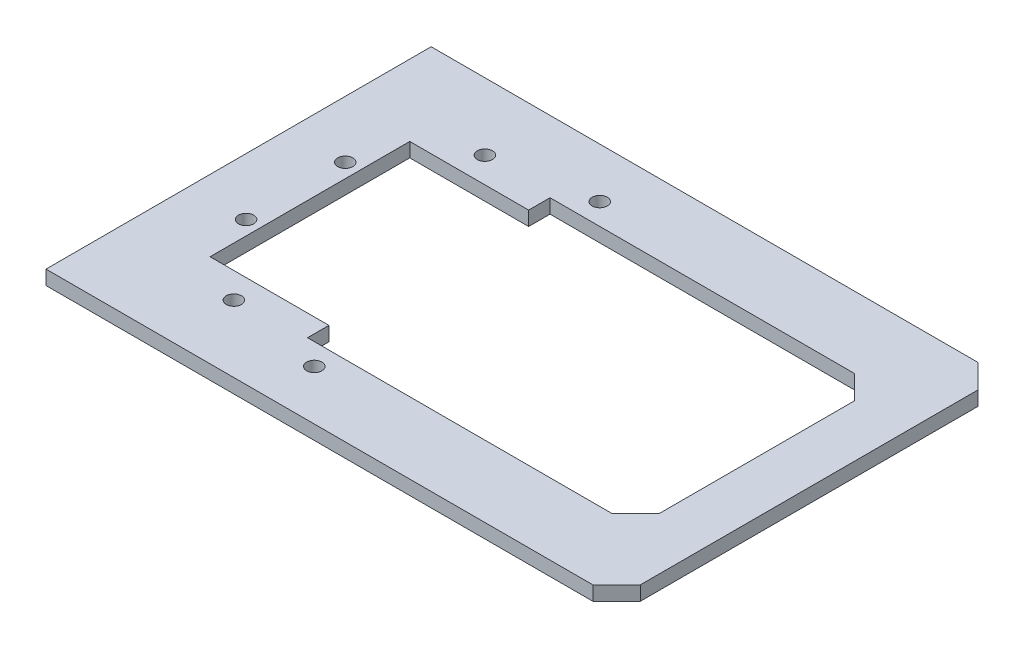
ISO-10303-21;
HEADER;
FILE_DESCRIPTION(('STEP AP214'),'2;1');
FILE_NAME('part.step','',(''),(''),'','','');
FILE_SCHEMA(('AUTOMOTIVE_DESIGN { 1 0 10303 214 1 1 1 1 }'));
ENDSEC;
DATA;
#1=APPLICATION_CONTEXT('core data for automotive mechanical design processes');
#2=APPLICATION_PROTOCOL_DEFINITION('international standard','automotive_design',2000,#1);
#3=PRODUCT_CONTEXT('',#1,'mechanical');
#4=PRODUCT('Part','Part','',(#3));
#5=PRODUCT_RELATED_PRODUCT_CATEGORY('part','',(#4));
#6=PRODUCT_DEFINITION_FORMATION('','',#4);
#7=PRODUCT_DEFINITION_CONTEXT('part definition',#1,'design');
#8=PRODUCT_DEFINITION('design','',#6,#7);
#9=PRODUCT_DEFINITION_SHAPE('','',#8);
#10=(LENGTH_UNIT() NAMED_UNIT(*) SI_UNIT(.MILLI.,.METRE.));
#11=(NAMED_UNIT(*) PLANE_ANGLE_UNIT() SI_UNIT($,.RADIAN.));
#12=(NAMED_UNIT(*) SI_UNIT($,.STERADIAN.) SOLID_ANGLE_UNIT());
#13=UNCERTAINTY_MEASURE_WITH_UNIT(LENGTH_MEASURE(1.E-05),#10,'distance_accuracy_value','');
#14=(GEOMETRIC_REPRESENTATION_CONTEXT(3) GLOBAL_UNCERTAINTY_ASSIGNED_CONTEXT((#13)) GLOBAL_UNIT_ASSIGNED_CONTEXT((#10,
#11,#12)) REPRESENTATION_CONTEXT('',''));
#15=CARTESIAN_POINT('',(0.,0.,0.));
#16=DIRECTION('',(0.,0.,1.));
#17=DIRECTION('',(1.,0.,0.));
#18=AXIS2_PLACEMENT_3D('',#15,#16,#17);
#19=CARTESIAN_POINT('',(0.,3.,0.));
#20=DIRECTION('',(0.,-1.,0.));
#21=DIRECTION('',(0.,0.,-1.));
#22=AXIS2_PLACEMENT_3D('',#19,#20,#21);
#23=PLANE('',#22);
#24=DIRECTION('',(-0.707106781186547,0.,-0.707106781186547));
#25=VECTOR('',#24,1.);
#26=CARTESIAN_POINT('',(86.5353178546709,3.,119.617214350325));
#27=LINE('',#26,#25);
#28=CARTESIAN_POINT('',(86.5353178546709,3.,119.617214350325));
#29=VERTEX_POINT('',#28);
#30=CARTESIAN_POINT('',(81.5353178546709,3.,114.617214350325));
#31=VERTEX_POINT('',#30);
#32=EDGE_CURVE('E230',#29,#31,#27,.T.);
#33=ORIENTED_EDGE('',*,*,#32,.T.);
#34=DIRECTION('',(-1.,0.,0.));
#35=VECTOR('',#34,1.);
#36=CARTESIAN_POINT('',(81.5353178546709,3.,114.617214350325));
#37=LINE('',#36,#35);
#38=CARTESIAN_POINT('',(-33.4646821453291,3.,114.617214350325));
#39=VERTEX_POINT('',#38);
#40=EDGE_CURVE('E233',#31,#39,#37,.T.);
#41=ORIENTED_EDGE('',*,*,#40,.T.);
#42=DIRECTION('',(0.,0.,1.));
#43=VECTOR('',#42,1.);
#44=CARTESIAN_POINT('',(-33.4646821453291,3.,114.617214350325));
#45=LINE('',#44,#43);
#46=CARTESIAN_POINT('',(-33.4646821453291,3.,195.617214350325));
#47=VERTEX_POINT('',#46);
#48=EDGE_CURVE('E236',#39,#47,#45,.T.);
#49=ORIENTED_EDGE('',*,*,#48,.T.);
#50=DIRECTION('',(1.,0.,0.));
#51=VECTOR('',#50,1.);
#52=CARTESIAN_POINT('',(-33.4646821453291,3.,195.617214350325));
#53=LINE('',#52,#51);
#54=CARTESIAN_POINT('',(81.5353178546709,3.,195.617214350325));
#55=VERTEX_POINT('',#54);
#56=EDGE_CURVE('E238',#47,#55,#53,.T.);
#57=ORIENTED_EDGE('',*,*,#56,.T.);
#58=DIRECTION('',(0.707106781186546,0.,-0.707106781186548));
#59=VECTOR('',#58,1.);
#60=CARTESIAN_POINT('',(81.5353178546709,3.,195.617214350325));
#61=LINE('',#60,#59);
#62=CARTESIAN_POINT('',(86.5353178546709,3.,190.617214350325));
#63=VERTEX_POINT('',#62);
#64=EDGE_CURVE('E240',#55,#63,#61,.T.);
#65=ORIENTED_EDGE('',*,*,#64,.T.);
#66=DIRECTION('',(0.,0.,-1.));
#67=VECTOR('',#66,1.);
#68=CARTESIAN_POINT('',(86.5353178546709,3.,190.617214350325));
#69=LINE('',#68,#67);
#70=EDGE_CURVE('E242',#63,#29,#69,.T.);
#71=ORIENTED_EDGE('',*,*,#70,.T.);
#72=EDGE_LOOP('',(#33,#41,#49,#57,#65,#71));
#73=FACE_BOUND('',#72,.T.);
#74=DIRECTION('',(-0.707106781186547,0.,-0.707106781186547));
#75=VECTOR('',#74,1.);
#76=CARTESIAN_POINT('',(70.5353178546709,3.,129.617214350325));
#77=LINE('',#76,#75);
#78=CARTESIAN_POINT('',(75.5353178546709,3.,134.617214350325));
#79=VERTEX_POINT('',#78);
#80=CARTESIAN_POINT('',(70.5353178546709,3.,129.617214350325));
#81=VERTEX_POINT('',#80);
#82=EDGE_CURVE('E148',#79,#81,#77,.T.);
#83=ORIENTED_EDGE('',*,*,#82,.F.);
#84=DIRECTION('',(0.,0.,-1.));
#85=VECTOR('',#84,1.);
#86=CARTESIAN_POINT('',(75.5353178546709,3.,134.617214350325));
#87=LINE('',#86,#85);
#88=CARTESIAN_POINT('',(75.5353178546709,3.,175.617214350325));
#89=VERTEX_POINT('',#88);
#90=EDGE_CURVE('E187',#89,#79,#87,.T.);
#91=ORIENTED_EDGE('',*,*,#90,.F.);
#92=DIRECTION('',(0.707106781186547,0.,-0.707106781186547));
#93=VECTOR('',#92,1.);
#94=CARTESIAN_POINT('',(75.5353178546709,3.,175.617214350325));
#95=LINE('',#94,#93);
#96=CARTESIAN_POINT('',(70.5353178546709,3.,180.617214350325));
#97=VERTEX_POINT('',#96);
#98=EDGE_CURVE('E185',#97,#89,#95,.T.);
#99=ORIENTED_EDGE('',*,*,#98,.F.);
#100=DIRECTION('',(1.,0.,0.));
#101=VECTOR('',#100,1.);
#102=CARTESIAN_POINT('',(70.5353178546709,3.,180.617214350325));
#103=LINE('',#102,#101);
#104=CARTESIAN_POINT('',(6.53531785467092,3.,180.617214350325));
#105=VERTEX_POINT('',#104);
#106=EDGE_CURVE('E183',#105,#97,#103,.T.);
#107=ORIENTED_EDGE('',*,*,#106,.F.);
#108=DIRECTION('',(0.,0.,1.));
#109=VECTOR('',#108,1.);
#110=CARTESIAN_POINT('',(6.53531785467092,3.,180.617214350325));
#111=LINE('',#110,#109);
#112=CARTESIAN_POINT('',(6.53531785467092,3.,176.117214350325));
#113=VERTEX_POINT('',#112);
#114=EDGE_CURVE('E181',#113,#105,#111,.T.);
#115=ORIENTED_EDGE('',*,*,#114,.F.);
#116=DIRECTION('',(1.,0.,0.));
#117=VECTOR('',#116,1.);
#118=CARTESIAN_POINT('',(6.53531785467092,3.,176.117214350325));
#119=LINE('',#118,#117);
#120=CARTESIAN_POINT('',(-18.4646821453291,3.,176.117214350325));
#121=VERTEX_POINT('',#120);
#122=EDGE_CURVE('E179',#121,#113,#119,.T.);
#123=ORIENTED_EDGE('',*,*,#122,.F.);
#124=DIRECTION('',(0.,0.,1.));
#125=VECTOR('',#124,1.);
#126=CARTESIAN_POINT('',(-18.4646821453291,3.,134.117214350325));
#127=LINE('',#126,#125);
#128=CARTESIAN_POINT('',(-18.4646821453291,3.,134.117214350325));
#129=VERTEX_POINT('',#128);
#130=EDGE_CURVE('E177',#129,#121,#127,.T.);
#131=ORIENTED_EDGE('',*,*,#130,.F.);
#132=DIRECTION('',(-1.,0.,0.));
#133=VECTOR('',#132,1.);
#134=CARTESIAN_POINT('',(-18.4646821453291,3.,134.117214350325));
#135=LINE('',#134,#133);
#136=CARTESIAN_POINT('',(6.53531785467092,3.,134.117214350325));
#137=VERTEX_POINT('',#136);
#138=EDGE_CURVE('E172',#137,#129,#135,.T.);
#139=ORIENTED_EDGE('',*,*,#138,.F.);
#140=DIRECTION('',(0.,0.,1.));
#141=VECTOR('',#140,1.);
#142=CARTESIAN_POINT('',(6.53531785467092,3.,134.117214350325));
#143=LINE('',#142,#141);
#144=CARTESIAN_POINT('',(6.53531785467092,3.,129.617214350325));
#145=VERTEX_POINT('',#144);
#146=EDGE_CURVE('E170',#145,#137,#143,.T.);
#147=ORIENTED_EDGE('',*,*,#146,.F.);
#148=DIRECTION('',(-1.,0.,0.));
#149=VECTOR('',#148,1.);
#150=CARTESIAN_POINT('',(6.53531785467092,3.,129.617214350325));
#151=LINE('',#150,#149);
#152=EDGE_CURVE('E156',#81,#145,#151,.T.);
#153=ORIENTED_EDGE('',*,*,#152,.F.);
#154=EDGE_LOOP('',(#83,#91,#99,#107,#115,#123,#131,#139,#147,#153));
#155=FACE_BOUND('',#154,.T.);
#156=CARTESIAN_POINT('',(12.4699453915134,3.,125.100274038513));
#157=DIRECTION('',(0.,1.,0.));
#158=DIRECTION('',(0.,0.,1.));
#159=AXIS2_PLACEMENT_3D('',#156,#157,#158);
#160=CIRCLE('',#159,1.6);
#161=CARTESIAN_POINT('',(12.4699453915134,3.,126.700274038513));
#162=VERTEX_POINT('',#161);
#163=EDGE_CURVE('E190',#162,#162,#160,.T.);
#164=ORIENTED_EDGE('',*,*,#163,.F.);
#165=EDGE_LOOP('',(#164));
#166=FACE_BOUND('',#165,.T.);
#167=CARTESIAN_POINT('',(-8.06285106377469,3.,128.720760042975));
#168=DIRECTION('',(0.,1.,0.));
#169=DIRECTION('',(0.,0.,1.));
#170=AXIS2_PLACEMENT_3D('',#167,#168,#169);
#171=CIRCLE('',#170,1.6);
#172=CARTESIAN_POINT('',(-8.06285106377469,3.,130.320760042975));
#173=VERTEX_POINT('',#172);
#174=EDGE_CURVE('E402',#173,#173,#171,.T.);
#175=ORIENTED_EDGE('',*,*,#174,.F.);
#176=EDGE_LOOP('',(#175));
#177=FACE_BOUND('',#176,.T.);
#178=CARTESIAN_POINT('',(-21.4646821453291,3.,144.692440381759));
#179=DIRECTION('',(0.,1.,0.));
#180=DIRECTION('',(0.,0.,1.));
#181=AXIS2_PLACEMENT_3D('',#178,#179,#180);
#182=CIRCLE('',#181,1.6);
#183=CARTESIAN_POINT('',(-21.4646821453291,3.,146.292440381759));
#184=VERTEX_POINT('',#183);
#185=EDGE_CURVE('E396',#184,#184,#182,.T.);
#186=ORIENTED_EDGE('',*,*,#185,.F.);
#187=EDGE_LOOP('',(#186));
#188=FACE_BOUND('',#187,.T.);
#189=CARTESIAN_POINT('',(-21.4646821453289,3.,165.541988318892));
#190=DIRECTION('',(0.,1.,0.));
#191=DIRECTION('',(0.,0.,1.));
#192=AXIS2_PLACEMENT_3D('',#189,#190,#191);
#193=CIRCLE('',#192,1.6);
#194=CARTESIAN_POINT('',(-21.4646821453289,3.,167.141988318892));
#195=VERTEX_POINT('',#194);
#196=EDGE_CURVE('E390',#195,#195,#193,.T.);
#197=ORIENTED_EDGE('',*,*,#196,.F.);
#198=EDGE_LOOP('',(#197));
#199=FACE_BOUND('',#198,.T.);
#200=CARTESIAN_POINT('',(-8.06285106377414,3.,181.513668657675));
#201=DIRECTION('',(0.,1.,0.));
#202=DIRECTION('',(0.,0.,1.));
#203=AXIS2_PLACEMENT_3D('',#200,#201,#202);
#204=CIRCLE('',#203,1.6);
#205=CARTESIAN_POINT('',(-8.06285106377414,3.,183.113668657675));
#206=VERTEX_POINT('',#205);
#207=EDGE_CURVE('E384',#206,#206,#204,.T.);
#208=ORIENTED_EDGE('',*,*,#207,.F.);
#209=EDGE_LOOP('',(#208));
#210=FACE_BOUND('',#209,.T.);
#211=CARTESIAN_POINT('',(12.469945391514,3.,185.134154662137));
#212=DIRECTION('',(0.,1.,0.));
#213=DIRECTION('',(0.,0.,1.));
#214=AXIS2_PLACEMENT_3D('',#211,#212,#213);
#215=CIRCLE('',#214,1.6);
#216=CARTESIAN_POINT('',(12.469945391514,3.,186.734154662137));
#217=VERTEX_POINT('',#216);
#218=EDGE_CURVE('E375',#217,#217,#215,.T.);
#219=ORIENTED_EDGE('',*,*,#218,.F.);
#220=EDGE_LOOP('',(#219));
#221=FACE_BOUND('',#220,.T.);
#222=ADVANCED_FACE('F35',(#73,#155,#166,#177,#188,#199,#210,#221),#23,.F.);
#223=CARTESIAN_POINT('',(0.,0.,0.));
#224=DIRECTION('',(0.,-1.,0.));
#225=DIRECTION('',(0.,0.,-1.));
#226=AXIS2_PLACEMENT_3D('',#223,#224,#225);
#227=PLANE('',#226);
#228=CARTESIAN_POINT('',(-8.06285106377414,0.,181.513668657675));
#229=DIRECTION('',(0.,1.,0.));
#230=DIRECTION('',(0.,0.,1.));
#231=AXIS2_PLACEMENT_3D('',#228,#229,#230);
#232=CIRCLE('',#231,1.6);
#233=CARTESIAN_POINT('',(-8.06285106377414,0.,183.113668657675));
#234=VERTEX_POINT('',#233);
#235=EDGE_CURVE('E381',#234,#234,#232,.T.);
#236=ORIENTED_EDGE('',*,*,#235,.T.);
#237=EDGE_LOOP('',(#236));
#238=FACE_BOUND('',#237,.T.);
#239=CARTESIAN_POINT('',(-21.4646821453291,0.,144.692440381759));
#240=DIRECTION('',(0.,1.,0.));
#241=DIRECTION('',(0.,0.,1.));
#242=AXIS2_PLACEMENT_3D('',#239,#240,#241);
#243=CIRCLE('',#242,1.6);
#244=CARTESIAN_POINT('',(-21.4646821453291,0.,146.292440381759));
#245=VERTEX_POINT('',#244);
#246=EDGE_CURVE('E393',#245,#245,#243,.T.);
#247=ORIENTED_EDGE('',*,*,#246,.T.);
#248=EDGE_LOOP('',(#247));
#249=FACE_BOUND('',#248,.T.);
#250=CARTESIAN_POINT('',(12.4699453915134,0.,125.100274038513));
#251=DIRECTION('',(0.,1.,0.));
#252=DIRECTION('',(0.,0.,1.));
#253=AXIS2_PLACEMENT_3D('',#250,#251,#252);
#254=CIRCLE('',#253,1.6);
#255=CARTESIAN_POINT('',(12.4699453915134,0.,126.700274038513));
#256=VERTEX_POINT('',#255);
#257=EDGE_CURVE('E405',#256,#256,#254,.T.);
#258=ORIENTED_EDGE('',*,*,#257,.T.);
#259=EDGE_LOOP('',(#258));
#260=FACE_BOUND('',#259,.T.);
#261=DIRECTION('',(-0.707106781186547,0.,-0.707106781186547));
#262=VECTOR('',#261,1.);
#263=CARTESIAN_POINT('',(86.5353178546709,0.,119.617214350325));
#264=LINE('',#263,#262);
#265=CARTESIAN_POINT('',(86.5353178546709,0.,119.617214350325));
#266=VERTEX_POINT('',#265);
#267=CARTESIAN_POINT('',(81.5353178546709,0.,114.617214350325));
#268=VERTEX_POINT('',#267);
#269=EDGE_CURVE('E164',#266,#268,#264,.T.);
#270=ORIENTED_EDGE('',*,*,#269,.F.);
#271=DIRECTION('',(0.,0.,-1.));
#272=VECTOR('',#271,1.);
#273=CARTESIAN_POINT('',(86.5353178546709,0.,129.617214350325));
#274=LINE('',#273,#272);
#275=CARTESIAN_POINT('',(86.5353178546709,0.,190.617214350325));
#276=VERTEX_POINT('',#275);
#277=EDGE_CURVE('E234',#276,#266,#274,.T.);
#278=ORIENTED_EDGE('',*,*,#277,.F.);
#279=DIRECTION('',(0.707106781186546,0.,-0.707106781186548));
#280=VECTOR('',#279,1.);
#281=CARTESIAN_POINT('',(81.5353178546709,0.,195.617214350325));
#282=LINE('',#281,#280);
#283=CARTESIAN_POINT('',(81.5353178546709,0.,195.617214350325));
#284=VERTEX_POINT('',#283);
#285=EDGE_CURVE('E253',#284,#276,#282,.T.);
#286=ORIENTED_EDGE('',*,*,#285,.F.);
#287=DIRECTION('',(1.,0.,0.));
#288=VECTOR('',#287,1.);
#289=CARTESIAN_POINT('',(-33.4646821453291,0.,195.617214350325));
#290=LINE('',#289,#288);
#291=CARTESIAN_POINT('',(-33.4646821453291,0.,195.617214350325));
#292=VERTEX_POINT('',#291);
#293=EDGE_CURVE('E251',#292,#284,#290,.T.);
#294=ORIENTED_EDGE('',*,*,#293,.F.);
#295=DIRECTION('',(0.,0.,1.));
#296=VECTOR('',#295,1.);
#297=CARTESIAN_POINT('',(-33.4646821453291,0.,114.617214350325));
#298=LINE('',#297,#296);
#299=CARTESIAN_POINT('',(-33.4646821453291,0.,114.617214350325));
#300=VERTEX_POINT('',#299);
#301=EDGE_CURVE('E249',#300,#292,#298,.T.);
#302=ORIENTED_EDGE('',*,*,#301,.F.);
#303=DIRECTION('',(-1.,0.,0.));
#304=VECTOR('',#303,1.);
#305=CARTESIAN_POINT('',(81.5353178546709,0.,114.617214350325));
#306=LINE('',#305,#304);
#307=EDGE_CURVE('E247',#268,#300,#306,.T.);
#308=ORIENTED_EDGE('',*,*,#307,.F.);
#309=EDGE_LOOP('',(#270,#278,#286,#294,#302,#308));
#310=FACE_BOUND('',#309,.T.);
#311=DIRECTION('',(0.,0.,-1.));
#312=VECTOR('',#311,1.);
#313=CARTESIAN_POINT('',(75.5353178546709,0.,134.617214350325));
#314=LINE('',#313,#312);
#315=CARTESIAN_POINT('',(75.5353178546709,0.,175.617214350325));
#316=VERTEX_POINT('',#315);
#317=CARTESIAN_POINT('',(75.5353178546709,0.,134.617214350325));
#318=VERTEX_POINT('',#317);
#319=EDGE_CURVE('E157',#316,#318,#314,.T.);
#320=ORIENTED_EDGE('',*,*,#319,.T.);
#321=DIRECTION('',(-0.707106781186547,0.,-0.707106781186547));
#322=VECTOR('',#321,1.);
#323=CARTESIAN_POINT('',(70.5353178546709,0.,129.617214350325));
#324=LINE('',#323,#322);
#325=CARTESIAN_POINT('',(70.5353178546709,0.,129.617214350325));
#326=VERTEX_POINT('',#325);
#327=EDGE_CURVE('E58',#318,#326,#324,.T.);
#328=ORIENTED_EDGE('',*,*,#327,.T.);
#329=DIRECTION('',(-1.,0.,0.));
#330=VECTOR('',#329,1.);
#331=CARTESIAN_POINT('',(6.53531785467092,0.,129.617214350325));
#332=LINE('',#331,#330);
#333=CARTESIAN_POINT('',(6.53531785467092,0.,129.617214350325));
#334=VERTEX_POINT('',#333);
#335=EDGE_CURVE('E163',#326,#334,#332,.T.);
#336=ORIENTED_EDGE('',*,*,#335,.T.);
#337=DIRECTION('',(0.,0.,1.));
#338=VECTOR('',#337,1.);
#339=CARTESIAN_POINT('',(6.53531785467092,0.,134.117214350325));
#340=LINE('',#339,#338);
#341=CARTESIAN_POINT('',(6.53531785467092,0.,134.117214350325));
#342=VERTEX_POINT('',#341);
#343=EDGE_CURVE('E192',#334,#342,#340,.T.);
#344=ORIENTED_EDGE('',*,*,#343,.T.);
#345=DIRECTION('',(-1.,0.,0.));
#346=VECTOR('',#345,1.);
#347=CARTESIAN_POINT('',(-18.4646821453291,0.,134.117214350325));
#348=LINE('',#347,#346);
#349=CARTESIAN_POINT('',(-18.4646821453291,0.,134.117214350325));
#350=VERTEX_POINT('',#349);
#351=EDGE_CURVE('E195',#342,#350,#348,.T.);
#352=ORIENTED_EDGE('',*,*,#351,.T.);
#353=DIRECTION('',(0.,0.,1.));
#354=VECTOR('',#353,1.);
#355=CARTESIAN_POINT('',(-18.4646821453291,0.,134.117214350325));
#356=LINE('',#355,#354);
#357=CARTESIAN_POINT('',(-18.4646821453291,0.,176.117214350325));
#358=VERTEX_POINT('',#357);
#359=EDGE_CURVE('E198',#350,#358,#356,.T.);
#360=ORIENTED_EDGE('',*,*,#359,.T.);
#361=DIRECTION('',(1.,0.,0.));
#362=VECTOR('',#361,1.);
#363=CARTESIAN_POINT('',(6.53531785467092,0.,176.117214350325));
#364=LINE('',#363,#362);
#365=CARTESIAN_POINT('',(6.53531785467092,0.,176.117214350325));
#366=VERTEX_POINT('',#365);
#367=EDGE_CURVE('E201',#358,#366,#364,.T.);
#368=ORIENTED_EDGE('',*,*,#367,.T.);
#369=DIRECTION('',(0.,0.,1.));
#370=VECTOR('',#369,1.);
#371=CARTESIAN_POINT('',(6.53531785467092,0.,180.617214350325));
#372=LINE('',#371,#370);
#373=CARTESIAN_POINT('',(6.53531785467092,0.,180.617214350325));
#374=VERTEX_POINT('',#373);
#375=EDGE_CURVE('E204',#366,#374,#372,.T.);
#376=ORIENTED_EDGE('',*,*,#375,.T.);
#377=DIRECTION('',(1.,0.,0.));
#378=VECTOR('',#377,1.);
#379=CARTESIAN_POINT('',(70.5353178546709,0.,180.617214350325));
#380=LINE('',#379,#378);
#381=CARTESIAN_POINT('',(70.5353178546709,0.,180.617214350325));
#382=VERTEX_POINT('',#381);
#383=EDGE_CURVE('E207',#374,#382,#380,.T.);
#384=ORIENTED_EDGE('',*,*,#383,.T.);
#385=DIRECTION('',(0.707106781186547,0.,-0.707106781186547));
#386=VECTOR('',#385,1.);
#387=CARTESIAN_POINT('',(75.5353178546709,0.,175.617214350325));
#388=LINE('',#387,#386);
#389=EDGE_CURVE('E210',#382,#316,#388,.T.);
#390=ORIENTED_EDGE('',*,*,#389,.T.);
#391=EDGE_LOOP('',(#320,#328,#336,#344,#352,#360,#368,#376,#384,#390));
#392=FACE_BOUND('',#391,.T.);
#393=CARTESIAN_POINT('',(-8.06285106377469,0.,128.720760042975));
#394=DIRECTION('',(0.,1.,0.));
#395=DIRECTION('',(0.,0.,1.));
#396=AXIS2_PLACEMENT_3D('',#393,#394,#395);
#397=CIRCLE('',#396,1.6);
#398=CARTESIAN_POINT('',(-8.06285106377469,0.,130.320760042975));
#399=VERTEX_POINT('',#398);
#400=EDGE_CURVE('E399',#399,#399,#397,.T.);
#401=ORIENTED_EDGE('',*,*,#400,.T.);
#402=EDGE_LOOP('',(#401));
#403=FACE_BOUND('',#402,.T.);
#404=CARTESIAN_POINT('',(-21.4646821453289,0.,165.541988318892));
#405=DIRECTION('',(0.,1.,0.));
#406=DIRECTION('',(0.,0.,1.));
#407=AXIS2_PLACEMENT_3D('',#404,#405,#406);
#408=CIRCLE('',#407,1.6);
#409=CARTESIAN_POINT('',(-21.4646821453289,0.,167.141988318892));
#410=VERTEX_POINT('',#409);
#411=EDGE_CURVE('E387',#410,#410,#408,.T.);
#412=ORIENTED_EDGE('',*,*,#411,.T.);
#413=EDGE_LOOP('',(#412));
#414=FACE_BOUND('',#413,.T.);
#415=CARTESIAN_POINT('',(12.469945391514,0.,185.134154662137));
#416=DIRECTION('',(0.,1.,0.));
#417=DIRECTION('',(0.,0.,1.));
#418=AXIS2_PLACEMENT_3D('',#415,#416,#417);
#419=CIRCLE('',#418,1.6);
#420=CARTESIAN_POINT('',(12.469945391514,0.,186.734154662137));
#421=VERTEX_POINT('',#420);
#422=EDGE_CURVE('E378',#421,#421,#419,.T.);
#423=ORIENTED_EDGE('',*,*,#422,.T.);
#424=EDGE_LOOP('',(#423));
#425=FACE_BOUND('',#424,.T.);
#426=ADVANCED_FACE('F278',(#238,#249,#260,#310,#392,#403,#414,#425),#227,.T.);
#427=CARTESIAN_POINT('',(86.5353178546709,3.,119.617214350325));
#428=DIRECTION('',(-0.707106781186548,0.,0.707106781186548));
#429=DIRECTION('',(0.707106781186548,0.,0.707106781186548));
#430=AXIS2_PLACEMENT_3D('',#427,#428,#429);
#431=PLANE('',#430);
#432=ORIENTED_EDGE('',*,*,#269,.T.);
#433=DIRECTION('',(0.,-1.,0.));
#434=VECTOR('',#433,1.);
#435=CARTESIAN_POINT('',(81.5353178546709,3.,114.617214350325));
#436=LINE('',#435,#434);
#437=EDGE_CURVE('E11',#31,#268,#436,.T.);
#438=ORIENTED_EDGE('',*,*,#437,.F.);
#439=ORIENTED_EDGE('',*,*,#32,.F.);
#440=DIRECTION('',(0.,-1.,0.));
#441=VECTOR('',#440,1.);
#442=CARTESIAN_POINT('',(86.5353178546709,3.,119.617214350325));
#443=LINE('',#442,#441);
#444=EDGE_CURVE('E244',#29,#266,#443,.T.);
#445=ORIENTED_EDGE('',*,*,#444,.T.);
#446=EDGE_LOOP('',(#432,#438,#439,#445));
#447=FACE_BOUND('',#446,.T.);
#448=ADVANCED_FACE('F37',(#447),#431,.F.);
#449=CARTESIAN_POINT('',(81.5353178546709,3.,114.617214350325));
#450=DIRECTION('',(0.,0.,1.));
#451=DIRECTION('',(1.,0.,0.));
#452=AXIS2_PLACEMENT_3D('',#449,#450,#451);
#453=PLANE('',#452);
#454=ORIENTED_EDGE('',*,*,#307,.T.);
#455=DIRECTION('',(0.,-1.,0.));
#456=VECTOR('',#455,1.);
#457=CARTESIAN_POINT('',(-33.4646821453291,3.,114.617214350325));
#458=LINE('',#457,#456);
#459=EDGE_CURVE('E43',#39,#300,#458,.T.);
#460=ORIENTED_EDGE('',*,*,#459,.F.);
#461=ORIENTED_EDGE('',*,*,#40,.F.);
#462=ORIENTED_EDGE('',*,*,#437,.T.);
#463=EDGE_LOOP('',(#454,#460,#461,#462));
#464=FACE_BOUND('',#463,.T.);
#465=ADVANCED_FACE('F294',(#464),#453,.F.);
#466=CARTESIAN_POINT('',(-33.4646821453291,3.,114.617214350325));
#467=DIRECTION('',(1.,0.,0.));
#468=DIRECTION('',(0.,0.,-1.));
#469=AXIS2_PLACEMENT_3D('',#466,#467,#468);
#470=PLANE('',#469);
#471=ORIENTED_EDGE('',*,*,#301,.T.);
#472=DIRECTION('',(0.,-1.,0.));
#473=VECTOR('',#472,1.);
#474=CARTESIAN_POINT('',(-33.4646821453291,3.,195.617214350325));
#475=LINE('',#474,#473);
#476=EDGE_CURVE('E265',#47,#292,#475,.T.);
#477=ORIENTED_EDGE('',*,*,#476,.F.);
#478=ORIENTED_EDGE('',*,*,#48,.F.);
#479=ORIENTED_EDGE('',*,*,#459,.T.);
#480=EDGE_LOOP('',(#471,#477,#478,#479));
#481=FACE_BOUND('',#480,.T.);
#482=ADVANCED_FACE('F272',(#481),#470,.F.);
#483=CARTESIAN_POINT('',(-33.4646821453291,3.,195.617214350325));
#484=DIRECTION('',(0.,0.,-1.));
#485=DIRECTION('',(-1.,0.,0.));
#486=AXIS2_PLACEMENT_3D('',#483,#484,#485);
#487=PLANE('',#486);
#488=ORIENTED_EDGE('',*,*,#293,.T.);
#489=DIRECTION('',(0.,-1.,0.));
#490=VECTOR('',#489,1.);
#491=CARTESIAN_POINT('',(81.5353178546709,3.,195.617214350325));
#492=LINE('',#491,#490);
#493=EDGE_CURVE('E262',#55,#284,#492,.T.);
#494=ORIENTED_EDGE('',*,*,#493,.F.);
#495=ORIENTED_EDGE('',*,*,#56,.F.);
#496=ORIENTED_EDGE('',*,*,#476,.T.);
#497=EDGE_LOOP('',(#488,#494,#495,#496));
#498=FACE_BOUND('',#497,.T.);
#499=ADVANCED_FACE('F283',(#498),#487,.F.);
#500=CARTESIAN_POINT('',(81.5353178546709,3.,195.617214350325));
#501=DIRECTION('',(-0.707106781186549,0.,-0.707106781186547));
#502=DIRECTION('',(-0.707106781186547,0.,0.707106781186549));
#503=AXIS2_PLACEMENT_3D('',#500,#501,#502);
#504=PLANE('',#503);
#505=ORIENTED_EDGE('',*,*,#285,.T.);
#506=DIRECTION('',(0.,-1.,0.));
#507=VECTOR('',#506,1.);
#508=CARTESIAN_POINT('',(86.5353178546709,3.,190.617214350325));
#509=LINE('',#508,#507);
#510=EDGE_CURVE('E259',#63,#276,#509,.T.);
#511=ORIENTED_EDGE('',*,*,#510,.F.);
#512=ORIENTED_EDGE('',*,*,#64,.F.);
#513=ORIENTED_EDGE('',*,*,#493,.T.);
#514=EDGE_LOOP('',(#505,#511,#512,#513));
#515=FACE_BOUND('',#514,.T.);
#516=ADVANCED_FACE('F287',(#515),#504,.F.);
#517=CARTESIAN_POINT('',(86.5353178546709,3.,129.617214350325));
#518=DIRECTION('',(-1.,0.,0.));
#519=DIRECTION('',(0.,0.,1.));
#520=AXIS2_PLACEMENT_3D('',#517,#518,#519);
#521=PLANE('',#520);
#522=ORIENTED_EDGE('',*,*,#277,.T.);
#523=ORIENTED_EDGE('',*,*,#444,.F.);
#524=ORIENTED_EDGE('',*,*,#70,.F.);
#525=ORIENTED_EDGE('',*,*,#510,.T.);
#526=EDGE_LOOP('',(#522,#523,#524,#525));
#527=FACE_BOUND('',#526,.T.);
#528=ADVANCED_FACE('F297',(#527),#521,.F.);
#529=CARTESIAN_POINT('',(70.5353178546709,3.,129.617214350325));
#530=DIRECTION('',(-0.707106781186548,0.,0.707106781186548));
#531=DIRECTION('',(0.707106781186548,0.,0.707106781186548));
#532=AXIS2_PLACEMENT_3D('',#529,#530,#531);
#533=PLANE('',#532);
#534=ORIENTED_EDGE('',*,*,#327,.F.);
#535=DIRECTION('',(0.,-1.,0.));
#536=VECTOR('',#535,1.);
#537=CARTESIAN_POINT('',(75.5353178546709,3.,134.617214350325));
#538=LINE('',#537,#536);
#539=EDGE_CURVE('E152',#79,#318,#538,.T.);
#540=ORIENTED_EDGE('',*,*,#539,.F.);
#541=ORIENTED_EDGE('',*,*,#82,.T.);
#542=DIRECTION('',(0.,-1.,0.));
#543=VECTOR('',#542,1.);
#544=CARTESIAN_POINT('',(70.5353178546709,3.,129.617214350325));
#545=LINE('',#544,#543);
#546=EDGE_CURVE('E151',#81,#326,#545,.T.);
#547=ORIENTED_EDGE('',*,*,#546,.T.);
#548=EDGE_LOOP('',(#534,#540,#541,#547));
#549=FACE_BOUND('',#548,.T.);
#550=ADVANCED_FACE('F150',(#549),#533,.T.);
#551=CARTESIAN_POINT('',(6.53531785467092,3.,129.617214350325));
#552=DIRECTION('',(0.,0.,1.));
#553=DIRECTION('',(1.,0.,0.));
#554=AXIS2_PLACEMENT_3D('',#551,#552,#553);
#555=PLANE('',#554);
#556=ORIENTED_EDGE('',*,*,#335,.F.);
#557=ORIENTED_EDGE('',*,*,#546,.F.);
#558=ORIENTED_EDGE('',*,*,#152,.T.);
#559=DIRECTION('',(0.,-1.,0.));
#560=VECTOR('',#559,1.);
#561=CARTESIAN_POINT('',(6.53531785467092,3.,129.617214350325));
#562=LINE('',#561,#560);
#563=EDGE_CURVE('E165',#145,#334,#562,.T.);
#564=ORIENTED_EDGE('',*,*,#563,.T.);
#565=EDGE_LOOP('',(#556,#557,#558,#564));
#566=FACE_BOUND('',#565,.T.);
#567=ADVANCED_FACE('F160',(#566),#555,.T.);
#568=CARTESIAN_POINT('',(6.53531785467092,3.,134.117214350325));
#569=DIRECTION('',(1.,0.,0.));
#570=DIRECTION('',(0.,0.,-1.));
#571=AXIS2_PLACEMENT_3D('',#568,#569,#570);
#572=PLANE('',#571);
#573=ORIENTED_EDGE('',*,*,#343,.F.);
#574=ORIENTED_EDGE('',*,*,#563,.F.);
#575=ORIENTED_EDGE('',*,*,#146,.T.);
#576=DIRECTION('',(0.,-1.,0.));
#577=VECTOR('',#576,1.);
#578=CARTESIAN_POINT('',(6.53531785467092,3.,134.117214350325));
#579=LINE('',#578,#577);
#580=EDGE_CURVE('E227',#137,#342,#579,.T.);
#581=ORIENTED_EDGE('',*,*,#580,.T.);
#582=EDGE_LOOP('',(#573,#574,#575,#581));
#583=FACE_BOUND('',#582,.T.);
#584=ADVANCED_FACE('F316',(#583),#572,.T.);
#585=CARTESIAN_POINT('',(-18.4646821453291,3.,134.117214350325));
#586=DIRECTION('',(0.,0.,1.));
#587=DIRECTION('',(1.,0.,0.));
#588=AXIS2_PLACEMENT_3D('',#585,#586,#587);
#589=PLANE('',#588);
#590=ORIENTED_EDGE('',*,*,#351,.F.);
#591=ORIENTED_EDGE('',*,*,#580,.F.);
#592=ORIENTED_EDGE('',*,*,#138,.T.);
#593=DIRECTION('',(0.,-1.,0.));
#594=VECTOR('',#593,1.);
#595=CARTESIAN_POINT('',(-18.4646821453291,3.,134.117214350325));
#596=LINE('',#595,#594);
#597=EDGE_CURVE('E225',#129,#350,#596,.T.);
#598=ORIENTED_EDGE('',*,*,#597,.T.);
#599=EDGE_LOOP('',(#590,#591,#592,#598));
#600=FACE_BOUND('',#599,.T.);
#601=ADVANCED_FACE('F319',(#600),#589,.T.);
#602=CARTESIAN_POINT('',(-18.4646821453291,3.,134.117214350325));
#603=DIRECTION('',(1.,0.,0.));
#604=DIRECTION('',(0.,0.,-1.));
#605=AXIS2_PLACEMENT_3D('',#602,#603,#604);
#606=PLANE('',#605);
#607=ORIENTED_EDGE('',*,*,#359,.F.);
#608=ORIENTED_EDGE('',*,*,#597,.F.);
#609=ORIENTED_EDGE('',*,*,#130,.T.);
#610=DIRECTION('',(0.,-1.,0.));
#611=VECTOR('',#610,1.);
#612=CARTESIAN_POINT('',(-18.4646821453291,3.,176.117214350325));
#613=LINE('',#612,#611);
#614=EDGE_CURVE('E223',#121,#358,#613,.T.);
#615=ORIENTED_EDGE('',*,*,#614,.T.);
#616=EDGE_LOOP('',(#607,#608,#609,#615));
#617=FACE_BOUND('',#616,.T.);
#618=ADVANCED_FACE('F323',(#617),#606,.T.);
#619=CARTESIAN_POINT('',(6.53531785467092,3.,176.117214350325));
#620=DIRECTION('',(0.,0.,-1.));
#621=DIRECTION('',(-1.,0.,0.));
#622=AXIS2_PLACEMENT_3D('',#619,#620,#621);
#623=PLANE('',#622);
#624=ORIENTED_EDGE('',*,*,#367,.F.);
#625=ORIENTED_EDGE('',*,*,#614,.F.);
#626=ORIENTED_EDGE('',*,*,#122,.T.);
#627=DIRECTION('',(0.,-1.,0.));
#628=VECTOR('',#627,1.);
#629=CARTESIAN_POINT('',(6.53531785467092,3.,176.117214350325));
#630=LINE('',#629,#628);
#631=EDGE_CURVE('E221',#113,#366,#630,.T.);
#632=ORIENTED_EDGE('',*,*,#631,.T.);
#633=EDGE_LOOP('',(#624,#625,#626,#632));
#634=FACE_BOUND('',#633,.T.);
#635=ADVANCED_FACE('F327',(#634),#623,.T.);
#636=CARTESIAN_POINT('',(6.53531785467092,3.,180.617214350325));
#637=DIRECTION('',(1.,0.,0.));
#638=DIRECTION('',(0.,0.,-1.));
#639=AXIS2_PLACEMENT_3D('',#636,#637,#638);
#640=PLANE('',#639);
#641=ORIENTED_EDGE('',*,*,#375,.F.);
#642=ORIENTED_EDGE('',*,*,#631,.F.);
#643=ORIENTED_EDGE('',*,*,#114,.T.);
#644=DIRECTION('',(0.,-1.,0.));
#645=VECTOR('',#644,1.);
#646=CARTESIAN_POINT('',(6.53531785467092,3.,180.617214350325));
#647=LINE('',#646,#645);
#648=EDGE_CURVE('E219',#105,#374,#647,.T.);
#649=ORIENTED_EDGE('',*,*,#648,.T.);
#650=EDGE_LOOP('',(#641,#642,#643,#649));
#651=FACE_BOUND('',#650,.T.);
#652=ADVANCED_FACE('F331',(#651),#640,.T.);
#653=CARTESIAN_POINT('',(70.5353178546709,3.,180.617214350325));
#654=DIRECTION('',(0.,0.,-1.));
#655=DIRECTION('',(-1.,0.,0.));
#656=AXIS2_PLACEMENT_3D('',#653,#654,#655);
#657=PLANE('',#656);
#658=ORIENTED_EDGE('',*,*,#383,.F.);
#659=ORIENTED_EDGE('',*,*,#648,.F.);
#660=ORIENTED_EDGE('',*,*,#106,.T.);
#661=DIRECTION('',(0.,-1.,0.));
#662=VECTOR('',#661,1.);
#663=CARTESIAN_POINT('',(70.5353178546709,3.,180.617214350325));
#664=LINE('',#663,#662);
#665=EDGE_CURVE('E217',#97,#382,#664,.T.);
#666=ORIENTED_EDGE('',*,*,#665,.T.);
#667=EDGE_LOOP('',(#658,#659,#660,#666));
#668=FACE_BOUND('',#667,.T.);
#669=ADVANCED_FACE('F335',(#668),#657,.T.);
#670=CARTESIAN_POINT('',(75.5353178546709,3.,175.617214350325));
#671=DIRECTION('',(-0.707106781186548,0.,-0.707106781186548));
#672=DIRECTION('',(-0.707106781186548,0.,0.707106781186548));
#673=AXIS2_PLACEMENT_3D('',#670,#671,#672);
#674=PLANE('',#673);
#675=ORIENTED_EDGE('',*,*,#389,.F.);
#676=ORIENTED_EDGE('',*,*,#665,.F.);
#677=ORIENTED_EDGE('',*,*,#98,.T.);
#678=DIRECTION('',(0.,-1.,0.));
#679=VECTOR('',#678,1.);
#680=CARTESIAN_POINT('',(75.5353178546709,3.,175.617214350325));
#681=LINE('',#680,#679);
#682=EDGE_CURVE('E50',#89,#316,#681,.T.);
#683=ORIENTED_EDGE('',*,*,#682,.T.);
#684=EDGE_LOOP('',(#675,#676,#677,#683));
#685=FACE_BOUND('',#684,.T.);
#686=ADVANCED_FACE('F339',(#685),#674,.T.);
#687=CARTESIAN_POINT('',(75.5353178546709,3.,134.617214350325));
#688=DIRECTION('',(-1.,0.,0.));
#689=DIRECTION('',(0.,0.,1.));
#690=AXIS2_PLACEMENT_3D('',#687,#688,#689);
#691=PLANE('',#690);
#692=ORIENTED_EDGE('',*,*,#319,.F.);
#693=ORIENTED_EDGE('',*,*,#682,.F.);
#694=ORIENTED_EDGE('',*,*,#90,.T.);
#695=ORIENTED_EDGE('',*,*,#539,.T.);
#696=EDGE_LOOP('',(#692,#693,#694,#695));
#697=FACE_BOUND('',#696,.T.);
#698=ADVANCED_FACE('F343',(#697),#691,.T.);
#699=CARTESIAN_POINT('',(12.4699453915134,3.,125.100274038513));
#700=DIRECTION('',(0.,-1.,0.));
#701=DIRECTION('',(0.,0.,-1.));
#702=AXIS2_PLACEMENT_3D('',#699,#700,#701);
#703=CYLINDRICAL_SURFACE('',#702,1.6);
#704=ORIENTED_EDGE('',*,*,#163,.T.);
#705=EDGE_LOOP('',(#704));
#706=FACE_BOUND('',#705,.T.);
#707=ORIENTED_EDGE('',*,*,#257,.F.);
#708=EDGE_LOOP('',(#707));
#709=FACE_BOUND('',#708,.T.);
#710=ADVANCED_FACE('F347',(#706,#709),#703,.F.);
#711=CARTESIAN_POINT('',(-8.06285106377469,3.,128.720760042975));
#712=DIRECTION('',(0.,-1.,0.));
#713=DIRECTION('',(0.,0.,-1.));
#714=AXIS2_PLACEMENT_3D('',#711,#712,#713);
#715=CYLINDRICAL_SURFACE('',#714,1.6);
#716=ORIENTED_EDGE('',*,*,#174,.T.);
#717=EDGE_LOOP('',(#716));
#718=FACE_BOUND('',#717,.T.);
#719=ORIENTED_EDGE('',*,*,#400,.F.);
#720=EDGE_LOOP('',(#719));
#721=FACE_BOUND('',#720,.T.);
#722=ADVANCED_FACE('F350',(#718,#721),#715,.F.);
#723=CARTESIAN_POINT('',(-21.4646821453291,3.,144.692440381759));
#724=DIRECTION('',(0.,-1.,0.));
#725=DIRECTION('',(0.,0.,-1.));
#726=AXIS2_PLACEMENT_3D('',#723,#724,#725);
#727=CYLINDRICAL_SURFACE('',#726,1.6);
#728=ORIENTED_EDGE('',*,*,#185,.T.);
#729=EDGE_LOOP('',(#728));
#730=FACE_BOUND('',#729,.T.);
#731=ORIENTED_EDGE('',*,*,#246,.F.);
#732=EDGE_LOOP('',(#731));
#733=FACE_BOUND('',#732,.T.);
#734=ADVANCED_FACE('F354',(#730,#733),#727,.F.);
#735=CARTESIAN_POINT('',(-21.4646821453289,3.,165.541988318892));
#736=DIRECTION('',(0.,-1.,0.));
#737=DIRECTION('',(0.,0.,-1.));
#738=AXIS2_PLACEMENT_3D('',#735,#736,#737);
#739=CYLINDRICAL_SURFACE('',#738,1.6);
#740=ORIENTED_EDGE('',*,*,#196,.T.);
#741=EDGE_LOOP('',(#740));
#742=FACE_BOUND('',#741,.T.);
#743=ORIENTED_EDGE('',*,*,#411,.F.);
#744=EDGE_LOOP('',(#743));
#745=FACE_BOUND('',#744,.T.);
#746=ADVANCED_FACE('F358',(#742,#745),#739,.F.);
#747=CARTESIAN_POINT('',(-8.06285106377414,3.,181.513668657675));
#748=DIRECTION('',(0.,-1.,0.));
#749=DIRECTION('',(0.,0.,-1.));
#750=AXIS2_PLACEMENT_3D('',#747,#748,#749);
#751=CYLINDRICAL_SURFACE('',#750,1.6);
#752=ORIENTED_EDGE('',*,*,#207,.T.);
#753=EDGE_LOOP('',(#752));
#754=FACE_BOUND('',#753,.T.);
#755=ORIENTED_EDGE('',*,*,#235,.F.);
#756=EDGE_LOOP('',(#755));
#757=FACE_BOUND('',#756,.T.);
#758=ADVANCED_FACE('F362',(#754,#757),#751,.F.);
#759=CARTESIAN_POINT('',(12.469945391514,3.,185.134154662137));
#760=DIRECTION('',(0.,-1.,0.));
#761=DIRECTION('',(0.,0.,-1.));
#762=AXIS2_PLACEMENT_3D('',#759,#760,#761);
#763=CYLINDRICAL_SURFACE('',#762,1.6);
#764=ORIENTED_EDGE('',*,*,#218,.T.);
#765=EDGE_LOOP('',(#764));
#766=FACE_BOUND('',#765,.T.);
#767=ORIENTED_EDGE('',*,*,#422,.F.);
#768=EDGE_LOOP('',(#767));
#769=FACE_BOUND('',#768,.T.);
#770=ADVANCED_FACE('F366',(#766,#769),#763,.F.);
#771=CLOSED_SHELL('',(#222,#426,#448,#465,#482,#499,#516,#528,#550,#567,#584,#601,#618,#635,
#652,#669,#686,#698,#710,#722,#734,#746,#758,#770));
#772=MANIFOLD_SOLID_BREP('B2',#771);
#773=ADVANCED_BREP_SHAPE_REPRESENTATION('',(#18,#772),#14);
#774=SHAPE_DEFINITION_REPRESENTATION(#9,#773);
ENDSEC;
END-ISO-10303-21;
